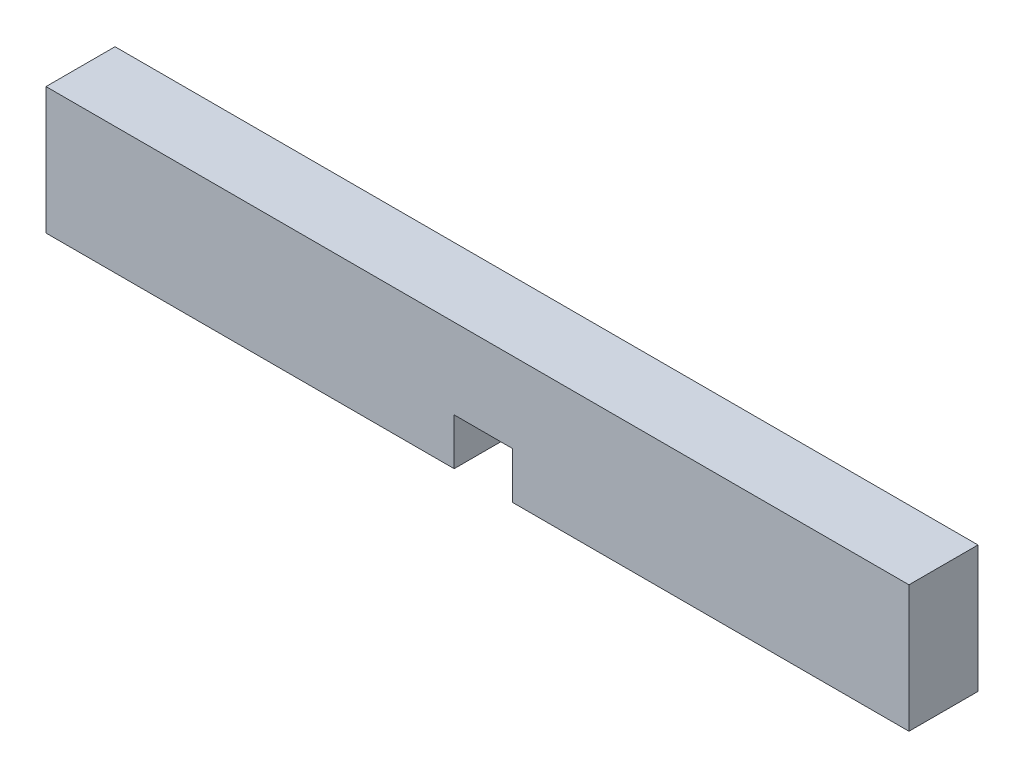
ISO-10303-21;
HEADER;
FILE_DESCRIPTION(('STEP AP214'),'2;1');
FILE_NAME('part.step','',(''),(''),'','','');
FILE_SCHEMA(('AUTOMOTIVE_DESIGN { 1 0 10303 214 1 1 1 1 }'));
ENDSEC;
DATA;
#1=APPLICATION_CONTEXT('core data for automotive mechanical design processes');
#2=APPLICATION_PROTOCOL_DEFINITION('international standard','automotive_design',2000,#1);
#3=PRODUCT_CONTEXT('',#1,'mechanical');
#4=PRODUCT('Part','Part','',(#3));
#5=PRODUCT_RELATED_PRODUCT_CATEGORY('part','',(#4));
#6=PRODUCT_DEFINITION_FORMATION('','',#4);
#7=PRODUCT_DEFINITION_CONTEXT('part definition',#1,'design');
#8=PRODUCT_DEFINITION('design','',#6,#7);
#9=PRODUCT_DEFINITION_SHAPE('','',#8);
#10=(LENGTH_UNIT() NAMED_UNIT(*) SI_UNIT(.MILLI.,.METRE.));
#11=(NAMED_UNIT(*) PLANE_ANGLE_UNIT() SI_UNIT($,.RADIAN.));
#12=(NAMED_UNIT(*) SI_UNIT($,.STERADIAN.) SOLID_ANGLE_UNIT());
#13=UNCERTAINTY_MEASURE_WITH_UNIT(LENGTH_MEASURE(1.E-05),#10,'distance_accuracy_value','');
#14=(GEOMETRIC_REPRESENTATION_CONTEXT(3) GLOBAL_UNCERTAINTY_ASSIGNED_CONTEXT((#13)) GLOBAL_UNIT_ASSIGNED_CONTEXT((#10,
#11,#12)) REPRESENTATION_CONTEXT('',''));
#15=CARTESIAN_POINT('',(0.,0.,0.));
#16=DIRECTION('',(0.,0.,1.));
#17=DIRECTION('',(1.,0.,0.));
#18=AXIS2_PLACEMENT_3D('',#15,#16,#17);
#19=CARTESIAN_POINT('',(0.,0.,4.699));
#20=DIRECTION('',(0.,1.,0.));
#21=DIRECTION('',(0.,0.,1.));
#22=AXIS2_PLACEMENT_3D('',#19,#20,#21);
#23=PLANE('',#22);
#24=DIRECTION('',(1.,0.,0.));
#25=VECTOR('',#24,1.);
#26=CARTESIAN_POINT('',(0.,0.,0.));
#27=LINE('',#26,#25);
#28=CARTESIAN_POINT('',(0.,0.,0.));
#29=VERTEX_POINT('',#28);
#30=CARTESIAN_POINT('',(27.78125,0.,0.));
#31=VERTEX_POINT('',#30);
#32=EDGE_CURVE('E118',#29,#31,#27,.T.);
#33=ORIENTED_EDGE('',*,*,#32,.T.);
#34=DIRECTION('',(0.,0.,1.));
#35=VECTOR('',#34,1.);
#36=CARTESIAN_POINT('',(27.78125,0.,0.));
#37=LINE('',#36,#35);
#38=CARTESIAN_POINT('',(27.78125,0.,4.699));
#39=VERTEX_POINT('',#38);
#40=EDGE_CURVE('E106',#31,#39,#37,.T.);
#41=ORIENTED_EDGE('',*,*,#40,.T.);
#42=DIRECTION('',(1.,0.,0.));
#43=VECTOR('',#42,1.);
#44=CARTESIAN_POINT('',(0.,0.,4.699));
#45=LINE('',#44,#43);
#46=CARTESIAN_POINT('',(0.,0.,4.699));
#47=VERTEX_POINT('',#46);
#48=EDGE_CURVE('E84',#47,#39,#45,.T.);
#49=ORIENTED_EDGE('',*,*,#48,.F.);
#50=DIRECTION('',(0.,0.,-1.));
#51=VECTOR('',#50,1.);
#52=CARTESIAN_POINT('',(0.,0.,4.699));
#53=LINE('',#52,#51);
#54=EDGE_CURVE('E11',#47,#29,#53,.T.);
#55=ORIENTED_EDGE('',*,*,#54,.T.);
#56=EDGE_LOOP('',(#33,#41,#49,#55));
#57=FACE_BOUND('',#56,.T.);
#58=ADVANCED_FACE('F32',(#57),#23,.F.);
#59=CARTESIAN_POINT('',(0.,0.,4.699));
#60=DIRECTION('',(1.,0.,0.));
#61=DIRECTION('',(0.,0.,-1.));
#62=AXIS2_PLACEMENT_3D('',#59,#60,#61);
#63=PLANE('',#62);
#64=DIRECTION('',(0.,-1.,0.));
#65=VECTOR('',#64,1.);
#66=CARTESIAN_POINT('',(0.,0.,0.));
#67=LINE('',#66,#65);
#68=CARTESIAN_POINT('',(0.,8.636,0.));
#69=VERTEX_POINT('',#68);
#70=EDGE_CURVE('E129',#69,#29,#67,.T.);
#71=ORIENTED_EDGE('',*,*,#70,.T.);
#72=ORIENTED_EDGE('',*,*,#54,.F.);
#73=DIRECTION('',(0.,-1.,0.));
#74=VECTOR('',#73,1.);
#75=CARTESIAN_POINT('',(0.,0.,4.699));
#76=LINE('',#75,#74);
#77=CARTESIAN_POINT('',(0.,8.636,4.699));
#78=VERTEX_POINT('',#77);
#79=EDGE_CURVE('E134',#78,#47,#76,.T.);
#80=ORIENTED_EDGE('',*,*,#79,.F.);
#81=DIRECTION('',(0.,0.,-1.));
#82=VECTOR('',#81,1.);
#83=CARTESIAN_POINT('',(0.,8.636,4.699));
#84=LINE('',#83,#82);
#85=EDGE_CURVE('E135',#78,#69,#84,.T.);
#86=ORIENTED_EDGE('',*,*,#85,.T.);
#87=EDGE_LOOP('',(#71,#72,#80,#86));
#88=FACE_BOUND('',#87,.T.);
#89=ADVANCED_FACE('F34',(#88),#63,.F.);
#90=CARTESIAN_POINT('',(31.75,0.,4.699));
#91=VERTEX_POINT('',#90);
#92=CARTESIAN_POINT('',(58.7375,0.,4.699));
#93=VERTEX_POINT('',#92);
#94=EDGE_CURVE('E160',#91,#93,#45,.T.);
#95=ORIENTED_EDGE('',*,*,#94,.F.);
#96=DIRECTION('',(0.,0.,1.));
#97=VECTOR('',#96,1.);
#98=CARTESIAN_POINT('',(31.75,0.,0.));
#99=LINE('',#98,#97);
#100=CARTESIAN_POINT('',(31.75,0.,0.));
#101=VERTEX_POINT('',#100);
#102=EDGE_CURVE('E113',#101,#91,#99,.T.);
#103=ORIENTED_EDGE('',*,*,#102,.F.);
#104=CARTESIAN_POINT('',(58.7375,0.,0.));
#105=VERTEX_POINT('',#104);
#106=EDGE_CURVE('E126',#101,#105,#27,.T.);
#107=ORIENTED_EDGE('',*,*,#106,.T.);
#108=DIRECTION('',(0.,0.,-1.));
#109=VECTOR('',#108,1.);
#110=CARTESIAN_POINT('',(58.7375,0.,4.699));
#111=LINE('',#110,#109);
#112=EDGE_CURVE('E40',#93,#105,#111,.T.);
#113=ORIENTED_EDGE('',*,*,#112,.F.);
#114=EDGE_LOOP('',(#95,#103,#107,#113));
#115=FACE_BOUND('',#114,.T.);
#116=ADVANCED_FACE('F175',(#115),#23,.F.);
#117=CARTESIAN_POINT('',(58.7375,0.,4.699));
#118=DIRECTION('',(-1.,0.,0.));
#119=DIRECTION('',(0.,0.,1.));
#120=AXIS2_PLACEMENT_3D('',#117,#118,#119);
#121=PLANE('',#120);
#122=DIRECTION('',(0.,1.,0.));
#123=VECTOR('',#122,1.);
#124=CARTESIAN_POINT('',(58.7375,0.,0.));
#125=LINE('',#124,#123);
#126=CARTESIAN_POINT('',(58.7375,8.636,0.));
#127=VERTEX_POINT('',#126);
#128=EDGE_CURVE('E125',#105,#127,#125,.T.);
#129=ORIENTED_EDGE('',*,*,#128,.T.);
#130=DIRECTION('',(0.,0.,-1.));
#131=VECTOR('',#130,1.);
#132=CARTESIAN_POINT('',(58.7375,8.636,4.699));
#133=LINE('',#132,#131);
#134=CARTESIAN_POINT('',(58.7375,8.636,4.699));
#135=VERTEX_POINT('',#134);
#136=EDGE_CURVE('E137',#135,#127,#133,.T.);
#137=ORIENTED_EDGE('',*,*,#136,.F.);
#138=DIRECTION('',(0.,1.,0.));
#139=VECTOR('',#138,1.);
#140=CARTESIAN_POINT('',(58.7375,0.,4.699));
#141=LINE('',#140,#139);
#142=EDGE_CURVE('E145',#93,#135,#141,.T.);
#143=ORIENTED_EDGE('',*,*,#142,.F.);
#144=ORIENTED_EDGE('',*,*,#112,.T.);
#145=EDGE_LOOP('',(#129,#137,#143,#144));
#146=FACE_BOUND('',#145,.T.);
#147=ADVANCED_FACE('F143',(#146),#121,.F.);
#148=CARTESIAN_POINT('',(0.,8.636,4.699));
#149=DIRECTION('',(0.,-1.,0.));
#150=DIRECTION('',(0.,0.,-1.));
#151=AXIS2_PLACEMENT_3D('',#148,#149,#150);
#152=PLANE('',#151);
#153=DIRECTION('',(-1.,0.,0.));
#154=VECTOR('',#153,1.);
#155=CARTESIAN_POINT('',(0.,8.636,0.));
#156=LINE('',#155,#154);
#157=EDGE_CURVE('E77',#127,#69,#156,.T.);
#158=ORIENTED_EDGE('',*,*,#157,.T.);
#159=ORIENTED_EDGE('',*,*,#85,.F.);
#160=DIRECTION('',(-1.,0.,0.));
#161=VECTOR('',#160,1.);
#162=CARTESIAN_POINT('',(0.,8.636,4.699));
#163=LINE('',#162,#161);
#164=EDGE_CURVE('E56',#135,#78,#163,.T.);
#165=ORIENTED_EDGE('',*,*,#164,.F.);
#166=ORIENTED_EDGE('',*,*,#136,.T.);
#167=EDGE_LOOP('',(#158,#159,#165,#166));
#168=FACE_BOUND('',#167,.T.);
#169=ADVANCED_FACE('F164',(#168),#152,.F.);
#170=CARTESIAN_POINT('',(0.,8.636,4.699));
#171=DIRECTION('',(0.,0.,-1.));
#172=DIRECTION('',(-1.,0.,0.));
#173=AXIS2_PLACEMENT_3D('',#170,#171,#172);
#174=PLANE('',#173);
#175=ORIENTED_EDGE('',*,*,#48,.T.);
#176=DIRECTION('',(0.,-1.,0.));
#177=VECTOR('',#176,1.);
#178=CARTESIAN_POINT('',(27.78125,0.,4.699));
#179=LINE('',#178,#177);
#180=CARTESIAN_POINT('',(27.78125,3.175,4.699));
#181=VERTEX_POINT('',#180);
#182=EDGE_CURVE('E111',#181,#39,#179,.T.);
#183=ORIENTED_EDGE('',*,*,#182,.F.);
#184=DIRECTION('',(-1.,0.,0.));
#185=VECTOR('',#184,1.);
#186=CARTESIAN_POINT('',(27.78125,3.175,4.699));
#187=LINE('',#186,#185);
#188=CARTESIAN_POINT('',(31.75,3.175,4.699));
#189=VERTEX_POINT('',#188);
#190=EDGE_CURVE('E121',#189,#181,#187,.T.);
#191=ORIENTED_EDGE('',*,*,#190,.F.);
#192=DIRECTION('',(0.,1.,0.));
#193=VECTOR('',#192,1.);
#194=CARTESIAN_POINT('',(31.75,0.,4.699));
#195=LINE('',#194,#193);
#196=EDGE_CURVE('E167',#91,#189,#195,.T.);
#197=ORIENTED_EDGE('',*,*,#196,.F.);
#198=ORIENTED_EDGE('',*,*,#94,.T.);
#199=ORIENTED_EDGE('',*,*,#142,.T.);
#200=ORIENTED_EDGE('',*,*,#164,.T.);
#201=ORIENTED_EDGE('',*,*,#79,.T.);
#202=EDGE_LOOP('',(#175,#183,#191,#197,#198,#199,#200,#201));
#203=FACE_BOUND('',#202,.T.);
#204=ADVANCED_FACE('F162',(#203),#174,.F.);
#205=CARTESIAN_POINT('',(0.,8.636,0.));
#206=DIRECTION('',(0.,0.,-1.));
#207=DIRECTION('',(-1.,0.,0.));
#208=AXIS2_PLACEMENT_3D('',#205,#206,#207);
#209=PLANE('',#208);
#210=DIRECTION('',(0.,-1.,0.));
#211=VECTOR('',#210,1.);
#212=CARTESIAN_POINT('',(27.78125,0.,0.));
#213=LINE('',#212,#211);
#214=CARTESIAN_POINT('',(27.78125,3.175,0.));
#215=VERTEX_POINT('',#214);
#216=EDGE_CURVE('E109',#215,#31,#213,.T.);
#217=ORIENTED_EDGE('',*,*,#216,.T.);
#218=ORIENTED_EDGE('',*,*,#32,.F.);
#219=ORIENTED_EDGE('',*,*,#70,.F.);
#220=ORIENTED_EDGE('',*,*,#157,.F.);
#221=ORIENTED_EDGE('',*,*,#128,.F.);
#222=ORIENTED_EDGE('',*,*,#106,.F.);
#223=DIRECTION('',(0.,1.,0.));
#224=VECTOR('',#223,1.);
#225=CARTESIAN_POINT('',(31.75,0.,0.));
#226=LINE('',#225,#224);
#227=CARTESIAN_POINT('',(31.75,3.175,0.));
#228=VERTEX_POINT('',#227);
#229=EDGE_CURVE('E120',#101,#228,#226,.T.);
#230=ORIENTED_EDGE('',*,*,#229,.T.);
#231=DIRECTION('',(-1.,0.,0.));
#232=VECTOR('',#231,1.);
#233=CARTESIAN_POINT('',(27.78125,3.175,0.));
#234=LINE('',#233,#232);
#235=EDGE_CURVE('E47',#228,#215,#234,.T.);
#236=ORIENTED_EDGE('',*,*,#235,.T.);
#237=EDGE_LOOP('',(#217,#218,#219,#220,#221,#222,#230,#236));
#238=FACE_BOUND('',#237,.T.);
#239=ADVANCED_FACE('F116',(#238),#209,.T.);
#240=CARTESIAN_POINT('',(27.78125,0.,0.));
#241=DIRECTION('',(-1.,0.,0.));
#242=DIRECTION('',(0.,0.,1.));
#243=AXIS2_PLACEMENT_3D('',#240,#241,#242);
#244=PLANE('',#243);
#245=ORIENTED_EDGE('',*,*,#182,.T.);
#246=ORIENTED_EDGE('',*,*,#40,.F.);
#247=ORIENTED_EDGE('',*,*,#216,.F.);
#248=DIRECTION('',(0.,0.,1.));
#249=VECTOR('',#248,1.);
#250=CARTESIAN_POINT('',(27.78125,3.175,0.));
#251=LINE('',#250,#249);
#252=EDGE_CURVE('E150',#215,#181,#251,.T.);
#253=ORIENTED_EDGE('',*,*,#252,.T.);
#254=EDGE_LOOP('',(#245,#246,#247,#253));
#255=FACE_BOUND('',#254,.T.);
#256=ADVANCED_FACE('F108',(#255),#244,.F.);
#257=CARTESIAN_POINT('',(27.78125,3.175,0.));
#258=DIRECTION('',(0.,1.,0.));
#259=DIRECTION('',(0.,0.,1.));
#260=AXIS2_PLACEMENT_3D('',#257,#258,#259);
#261=PLANE('',#260);
#262=ORIENTED_EDGE('',*,*,#190,.T.);
#263=ORIENTED_EDGE('',*,*,#252,.F.);
#264=ORIENTED_EDGE('',*,*,#235,.F.);
#265=DIRECTION('',(0.,0.,1.));
#266=VECTOR('',#265,1.);
#267=CARTESIAN_POINT('',(31.75,3.175,0.));
#268=LINE('',#267,#266);
#269=EDGE_CURVE('E151',#228,#189,#268,.T.);
#270=ORIENTED_EDGE('',*,*,#269,.T.);
#271=EDGE_LOOP('',(#262,#263,#264,#270));
#272=FACE_BOUND('',#271,.T.);
#273=ADVANCED_FACE('F224',(#272),#261,.F.);
#274=CARTESIAN_POINT('',(31.75,0.,0.));
#275=DIRECTION('',(1.,0.,0.));
#276=DIRECTION('',(0.,0.,-1.));
#277=AXIS2_PLACEMENT_3D('',#274,#275,#276);
#278=PLANE('',#277);
#279=ORIENTED_EDGE('',*,*,#196,.T.);
#280=ORIENTED_EDGE('',*,*,#269,.F.);
#281=ORIENTED_EDGE('',*,*,#229,.F.);
#282=ORIENTED_EDGE('',*,*,#102,.T.);
#283=EDGE_LOOP('',(#279,#280,#281,#282));
#284=FACE_BOUND('',#283,.T.);
#285=ADVANCED_FACE('F174',(#284),#278,.F.);
#286=CLOSED_SHELL('',(#58,#89,#116,#147,#169,#204,#239,#256,#273,#285));
#287=MANIFOLD_SOLID_BREP('B2',#286);
#288=ADVANCED_BREP_SHAPE_REPRESENTATION('',(#18,#287),#14);
#289=SHAPE_DEFINITION_REPRESENTATION(#9,#288);
ENDSEC;
END-ISO-10303-21;
